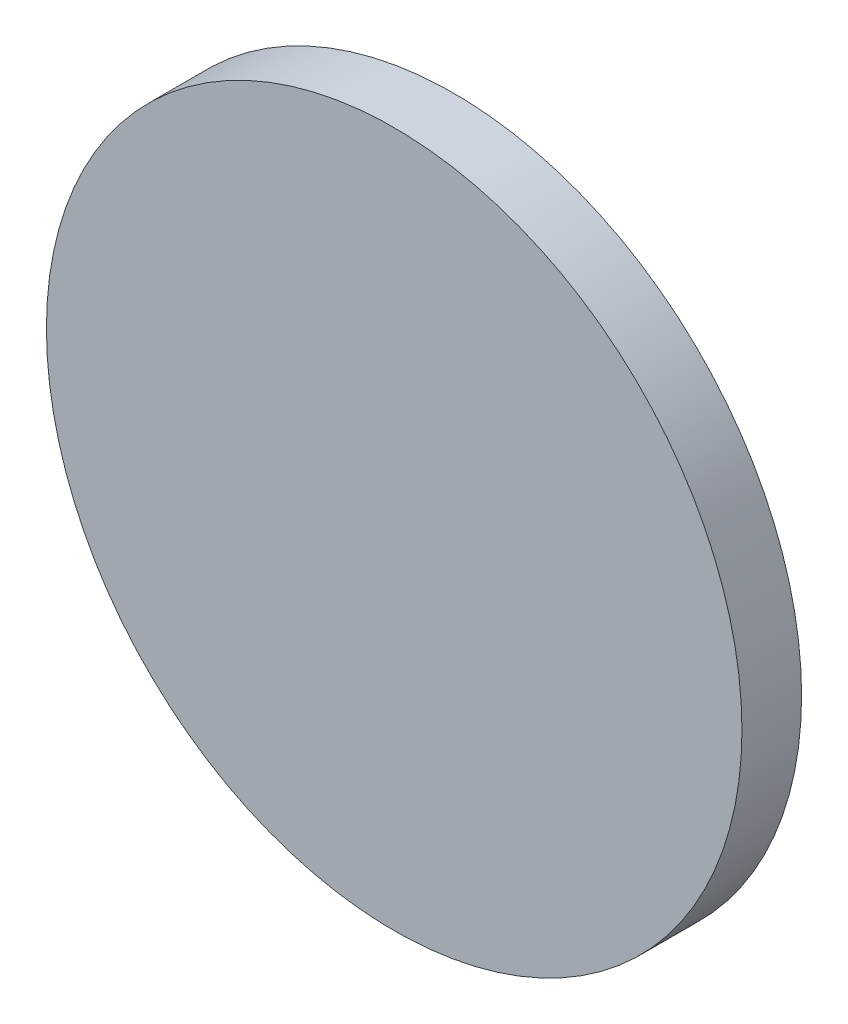
ISO-10303-21;
HEADER;
FILE_DESCRIPTION(('STEP AP214'),'2;1');
FILE_NAME('part.step','',(''),(''),'','','');
FILE_SCHEMA(('AUTOMOTIVE_DESIGN { 1 0 10303 214 1 1 1 1 }'));
ENDSEC;
DATA;
#1=APPLICATION_CONTEXT('core data for automotive mechanical design processes');
#2=APPLICATION_PROTOCOL_DEFINITION('international standard','automotive_design',2000,#1);
#3=PRODUCT_CONTEXT('',#1,'mechanical');
#4=PRODUCT('Part','Part','',(#3));
#5=PRODUCT_RELATED_PRODUCT_CATEGORY('part','',(#4));
#6=PRODUCT_DEFINITION_FORMATION('','',#4);
#7=PRODUCT_DEFINITION_CONTEXT('part definition',#1,'design');
#8=PRODUCT_DEFINITION('design','',#6,#7);
#9=PRODUCT_DEFINITION_SHAPE('','',#8);
#10=(LENGTH_UNIT() NAMED_UNIT(*) SI_UNIT(.MILLI.,.METRE.));
#11=(NAMED_UNIT(*) PLANE_ANGLE_UNIT() SI_UNIT($,.RADIAN.));
#12=(NAMED_UNIT(*) SI_UNIT($,.STERADIAN.) SOLID_ANGLE_UNIT());
#13=UNCERTAINTY_MEASURE_WITH_UNIT(LENGTH_MEASURE(1.E-05),#10,'distance_accuracy_value','');
#14=(GEOMETRIC_REPRESENTATION_CONTEXT(3) GLOBAL_UNCERTAINTY_ASSIGNED_CONTEXT((#13)) GLOBAL_UNIT_ASSIGNED_CONTEXT((#10,
#11,#12)) REPRESENTATION_CONTEXT('',''));
#15=CARTESIAN_POINT('',(0.,0.,0.));
#16=DIRECTION('',(0.,0.,1.));
#17=DIRECTION('',(1.,0.,0.));
#18=AXIS2_PLACEMENT_3D('',#15,#16,#17);
#19=CARTESIAN_POINT('',(11.409,6.178000014875,0.76487));
#20=DIRECTION('',(0.,0.,-1.));
#21=DIRECTION('',(-1.,0.,0.));
#22=AXIS2_PLACEMENT_3D('',#19,#20,#21);
#23=PLANE('',#22);
#24=CARTESIAN_POINT('',(11.409,6.178000014875,0.76487));
#25=DIRECTION('',(0.,0.,1.));
#26=DIRECTION('',(1.,0.,0.));
#27=AXIS2_PLACEMENT_3D('',#24,#25,#26);
#28=CIRCLE('',#27,0.200024667);
#29=CARTESIAN_POINT('',(11.609024667,6.178000014875,0.76487));
#30=VERTEX_POINT('',#29);
#31=EDGE_CURVE('E18',#30,#30,#28,.T.);
#32=ORIENTED_EDGE('',*,*,#31,.F.);
#33=EDGE_LOOP('',(#32));
#34=FACE_BOUND('',#33,.T.);
#35=ADVANCED_FACE('F15',(#34),#23,.T.);
#36=CARTESIAN_POINT('',(11.409,6.178000014875,0.76487));
#37=DIRECTION('',(0.,0.,1.));
#38=DIRECTION('',(1.,0.,0.));
#39=AXIS2_PLACEMENT_3D('',#36,#37,#38);
#40=CYLINDRICAL_SURFACE('',#39,0.200024667);
#41=CARTESIAN_POINT('',(11.409,6.178000014875,0.79916));
#42=DIRECTION('',(0.,0.,1.));
#43=DIRECTION('',(1.,0.,0.));
#44=AXIS2_PLACEMENT_3D('',#41,#42,#43);
#45=CIRCLE('',#44,0.200024667);
#46=CARTESIAN_POINT('',(11.609024667,6.178000014875,0.79916));
#47=VERTEX_POINT('',#46);
#48=EDGE_CURVE('E10',#47,#47,#45,.T.);
#49=ORIENTED_EDGE('',*,*,#48,.F.);
#50=EDGE_LOOP('',(#49));
#51=FACE_BOUND('',#50,.T.);
#52=ORIENTED_EDGE('',*,*,#31,.T.);
#53=EDGE_LOOP('',(#52));
#54=FACE_BOUND('',#53,.T.);
#55=ADVANCED_FACE('F27',(#51,#54),#40,.T.);
#56=CARTESIAN_POINT('',(11.409,6.178000014875,0.79916));
#57=DIRECTION('',(0.,0.,1.));
#58=DIRECTION('',(1.,0.,0.));
#59=AXIS2_PLACEMENT_3D('',#56,#57,#58);
#60=PLANE('',#59);
#61=ORIENTED_EDGE('',*,*,#48,.T.);
#62=EDGE_LOOP('',(#61));
#63=FACE_BOUND('',#62,.T.);
#64=ADVANCED_FACE('F34',(#63),#60,.T.);
#65=CLOSED_SHELL('',(#35,#55,#64));
#66=MANIFOLD_SOLID_BREP('B1',#65);
#67=ADVANCED_BREP_SHAPE_REPRESENTATION('',(#18,#66),#14);
#68=SHAPE_DEFINITION_REPRESENTATION(#9,#67);
ENDSEC;
END-ISO-10303-21;
